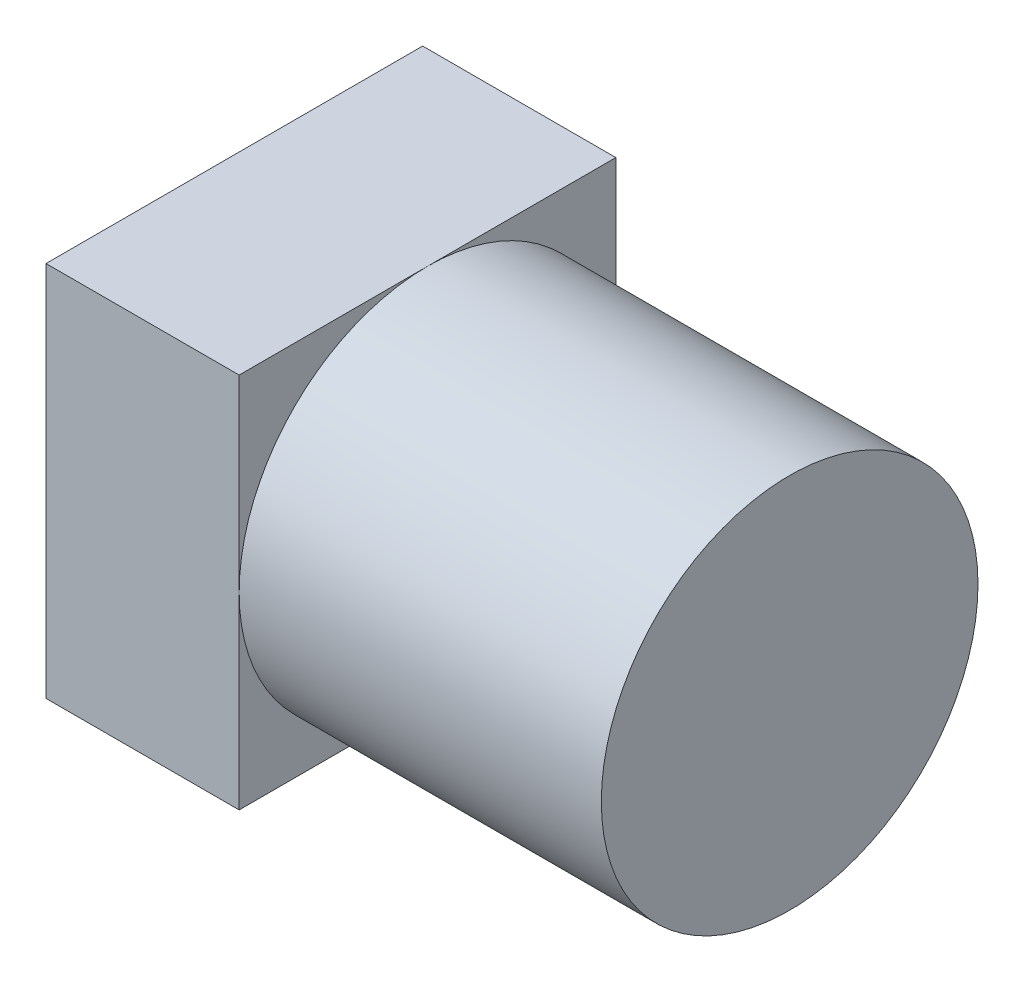
ISO-10303-21;
HEADER;
FILE_DESCRIPTION(('STEP AP214'),'2;1');
FILE_NAME('part.step','',(''),(''),'','','');
FILE_SCHEMA(('AUTOMOTIVE_DESIGN { 1 0 10303 214 1 1 1 1 }'));
ENDSEC;
DATA;
#1=APPLICATION_CONTEXT('core data for automotive mechanical design processes');
#2=APPLICATION_PROTOCOL_DEFINITION('international standard','automotive_design',2000,#1);
#3=PRODUCT_CONTEXT('',#1,'mechanical');
#4=PRODUCT('Part','Part','',(#3));
#5=PRODUCT_RELATED_PRODUCT_CATEGORY('part','',(#4));
#6=PRODUCT_DEFINITION_FORMATION('','',#4);
#7=PRODUCT_DEFINITION_CONTEXT('part definition',#1,'design');
#8=PRODUCT_DEFINITION('design','',#6,#7);
#9=PRODUCT_DEFINITION_SHAPE('','',#8);
#10=(LENGTH_UNIT() NAMED_UNIT(*) SI_UNIT(.MILLI.,.METRE.));
#11=(NAMED_UNIT(*) PLANE_ANGLE_UNIT() SI_UNIT($,.RADIAN.));
#12=(NAMED_UNIT(*) SI_UNIT($,.STERADIAN.) SOLID_ANGLE_UNIT());
#13=UNCERTAINTY_MEASURE_WITH_UNIT(LENGTH_MEASURE(1.E-05),#10,'distance_accuracy_value','');
#14=(GEOMETRIC_REPRESENTATION_CONTEXT(3) GLOBAL_UNCERTAINTY_ASSIGNED_CONTEXT((#13)) GLOBAL_UNIT_ASSIGNED_CONTEXT((#10,
#11,#12)) REPRESENTATION_CONTEXT('',''));
#15=CARTESIAN_POINT('',(0.,0.,0.));
#16=DIRECTION('',(0.,0.,1.));
#17=DIRECTION('',(1.,0.,0.));
#18=AXIS2_PLACEMENT_3D('',#15,#16,#17);
#19=CARTESIAN_POINT('',(8.,0.,0.));
#20=DIRECTION('',(1.,0.,0.));
#21=DIRECTION('',(0.,0.,-1.));
#22=AXIS2_PLACEMENT_3D('',#19,#20,#21);
#23=PLANE('',#22);
#24=CARTESIAN_POINT('',(8.,0.,0.));
#25=DIRECTION('',(1.,0.,0.));
#26=DIRECTION('',(0.,0.,-1.));
#27=AXIS2_PLACEMENT_3D('',#24,#25,#26);
#28=CIRCLE('',#27,7.8);
#29=CARTESIAN_POINT('',(8.,0.,-7.8));
#30=VERTEX_POINT('',#29);
#31=CARTESIAN_POINT('',(8.,7.8,0.));
#32=VERTEX_POINT('',#31);
#33=EDGE_CURVE('E51',#30,#32,#28,.T.);
#34=ORIENTED_EDGE('',*,*,#33,.F.);
#35=DIRECTION('',(0.,1.,0.));
#36=VECTOR('',#35,1.);
#37=CARTESIAN_POINT('',(8.,7.8,-7.8));
#38=LINE('',#37,#36);
#39=CARTESIAN_POINT('',(8.,7.8,-7.8));
#40=VERTEX_POINT('',#39);
#41=EDGE_CURVE('E103',#30,#40,#38,.T.);
#42=ORIENTED_EDGE('',*,*,#41,.T.);
#43=DIRECTION('',(0.,0.,1.));
#44=VECTOR('',#43,1.);
#45=CARTESIAN_POINT('',(8.,7.8,7.8));
#46=LINE('',#45,#44);
#47=EDGE_CURVE('E115',#40,#32,#46,.T.);
#48=ORIENTED_EDGE('',*,*,#47,.T.);
#49=EDGE_LOOP('',(#34,#42,#48));
#50=FACE_BOUND('',#49,.T.);
#51=ADVANCED_FACE('F39',(#50),#23,.T.);
#52=CARTESIAN_POINT('',(8.,0.,7.8));
#53=VERTEX_POINT('',#52);
#54=EDGE_CURVE('E11',#32,#53,#28,.T.);
#55=ORIENTED_EDGE('',*,*,#54,.F.);
#56=CARTESIAN_POINT('',(8.,7.8,7.8));
#57=VERTEX_POINT('',#56);
#58=EDGE_CURVE('E102',#32,#57,#46,.T.);
#59=ORIENTED_EDGE('',*,*,#58,.T.);
#60=DIRECTION('',(0.,-1.,0.));
#61=VECTOR('',#60,1.);
#62=CARTESIAN_POINT('',(8.,7.8,7.8));
#63=LINE('',#62,#61);
#64=EDGE_CURVE('E129',#57,#53,#63,.T.);
#65=ORIENTED_EDGE('',*,*,#64,.T.);
#66=EDGE_LOOP('',(#55,#59,#65));
#67=FACE_BOUND('',#66,.T.);
#68=ADVANCED_FACE('F172',(#67),#23,.T.);
#69=CARTESIAN_POINT('',(8.,-7.8,0.));
#70=VERTEX_POINT('',#69);
#71=EDGE_CURVE('E49',#53,#70,#28,.T.);
#72=ORIENTED_EDGE('',*,*,#71,.F.);
#73=CARTESIAN_POINT('',(8.,-7.8,7.8));
#74=VERTEX_POINT('',#73);
#75=EDGE_CURVE('E128',#53,#74,#63,.T.);
#76=ORIENTED_EDGE('',*,*,#75,.T.);
#77=DIRECTION('',(0.,0.,-1.));
#78=VECTOR('',#77,1.);
#79=CARTESIAN_POINT('',(8.,-7.8,7.8));
#80=LINE('',#79,#78);
#81=EDGE_CURVE('E133',#74,#70,#80,.T.);
#82=ORIENTED_EDGE('',*,*,#81,.T.);
#83=EDGE_LOOP('',(#72,#76,#82));
#84=FACE_BOUND('',#83,.T.);
#85=ADVANCED_FACE('F193',(#84),#23,.T.);
#86=CARTESIAN_POINT('',(8.,7.8,-7.8));
#87=DIRECTION('',(0.,0.,1.));
#88=DIRECTION('',(0.,-1.,0.));
#89=AXIS2_PLACEMENT_3D('',#86,#87,#88);
#90=PLANE('',#89);
#91=DIRECTION('',(0.,1.,0.));
#92=VECTOR('',#91,1.);
#93=CARTESIAN_POINT('',(0.,7.8,-7.8));
#94=LINE('',#93,#92);
#95=CARTESIAN_POINT('',(0.,-7.8,-7.8));
#96=VERTEX_POINT('',#95);
#97=CARTESIAN_POINT('',(0.,7.8,-7.8));
#98=VERTEX_POINT('',#97);
#99=EDGE_CURVE('E137',#96,#98,#94,.T.);
#100=ORIENTED_EDGE('',*,*,#99,.T.);
#101=DIRECTION('',(-1.,0.,0.));
#102=VECTOR('',#101,1.);
#103=CARTESIAN_POINT('',(8.,7.8,-7.8));
#104=LINE('',#103,#102);
#105=EDGE_CURVE('E43',#40,#98,#104,.T.);
#106=ORIENTED_EDGE('',*,*,#105,.F.);
#107=ORIENTED_EDGE('',*,*,#41,.F.);
#108=CARTESIAN_POINT('',(8.,-7.8,-7.8));
#109=VERTEX_POINT('',#108);
#110=EDGE_CURVE('E94',#109,#30,#38,.T.);
#111=ORIENTED_EDGE('',*,*,#110,.F.);
#112=DIRECTION('',(-1.,0.,0.));
#113=VECTOR('',#112,1.);
#114=CARTESIAN_POINT('',(8.,-7.8,-7.8));
#115=LINE('',#114,#113);
#116=EDGE_CURVE('E136',#109,#96,#115,.T.);
#117=ORIENTED_EDGE('',*,*,#116,.T.);
#118=EDGE_LOOP('',(#100,#106,#107,#111,#117));
#119=FACE_BOUND('',#118,.T.);
#120=ADVANCED_FACE('F41',(#119),#90,.F.);
#121=CARTESIAN_POINT('',(8.,7.8,7.8));
#122=DIRECTION('',(0.,-1.,0.));
#123=DIRECTION('',(0.,0.,-1.));
#124=AXIS2_PLACEMENT_3D('',#121,#122,#123);
#125=PLANE('',#124);
#126=DIRECTION('',(0.,0.,1.));
#127=VECTOR('',#126,1.);
#128=CARTESIAN_POINT('',(0.,7.8,7.8));
#129=LINE('',#128,#127);
#130=CARTESIAN_POINT('',(0.,7.8,7.8));
#131=VERTEX_POINT('',#130);
#132=EDGE_CURVE('E140',#98,#131,#129,.T.);
#133=ORIENTED_EDGE('',*,*,#132,.T.);
#134=DIRECTION('',(-1.,0.,0.));
#135=VECTOR('',#134,1.);
#136=CARTESIAN_POINT('',(8.,7.8,7.8));
#137=LINE('',#136,#135);
#138=EDGE_CURVE('E123',#57,#131,#137,.T.);
#139=ORIENTED_EDGE('',*,*,#138,.F.);
#140=ORIENTED_EDGE('',*,*,#58,.F.);
#141=ORIENTED_EDGE('',*,*,#47,.F.);
#142=ORIENTED_EDGE('',*,*,#105,.T.);
#143=EDGE_LOOP('',(#133,#139,#140,#141,#142));
#144=FACE_BOUND('',#143,.T.);
#145=ADVANCED_FACE('F203',(#144),#125,.F.);
#146=CARTESIAN_POINT('',(8.,7.8,7.8));
#147=DIRECTION('',(0.,0.,-1.));
#148=DIRECTION('',(0.,1.,0.));
#149=AXIS2_PLACEMENT_3D('',#146,#147,#148);
#150=PLANE('',#149);
#151=DIRECTION('',(0.,-1.,0.));
#152=VECTOR('',#151,1.);
#153=CARTESIAN_POINT('',(0.,7.8,7.8));
#154=LINE('',#153,#152);
#155=CARTESIAN_POINT('',(0.,-7.8,7.8));
#156=VERTEX_POINT('',#155);
#157=EDGE_CURVE('E143',#131,#156,#154,.T.);
#158=ORIENTED_EDGE('',*,*,#157,.T.);
#159=DIRECTION('',(-1.,0.,0.));
#160=VECTOR('',#159,1.);
#161=CARTESIAN_POINT('',(8.,-7.8,7.8));
#162=LINE('',#161,#160);
#163=EDGE_CURVE('E150',#74,#156,#162,.T.);
#164=ORIENTED_EDGE('',*,*,#163,.F.);
#165=ORIENTED_EDGE('',*,*,#75,.F.);
#166=ORIENTED_EDGE('',*,*,#64,.F.);
#167=ORIENTED_EDGE('',*,*,#138,.T.);
#168=EDGE_LOOP('',(#158,#164,#165,#166,#167));
#169=FACE_BOUND('',#168,.T.);
#170=ADVANCED_FACE('F159',(#169),#150,.F.);
#171=CARTESIAN_POINT('',(8.,-7.8,7.8));
#172=DIRECTION('',(0.,1.,0.));
#173=DIRECTION('',(0.,0.,1.));
#174=AXIS2_PLACEMENT_3D('',#171,#172,#173);
#175=PLANE('',#174);
#176=DIRECTION('',(0.,0.,-1.));
#177=VECTOR('',#176,1.);
#178=CARTESIAN_POINT('',(0.,-7.8,7.8));
#179=LINE('',#178,#177);
#180=EDGE_CURVE('E113',#156,#96,#179,.T.);
#181=ORIENTED_EDGE('',*,*,#180,.T.);
#182=ORIENTED_EDGE('',*,*,#116,.F.);
#183=EDGE_CURVE('E97',#70,#109,#80,.T.);
#184=ORIENTED_EDGE('',*,*,#183,.F.);
#185=ORIENTED_EDGE('',*,*,#81,.F.);
#186=ORIENTED_EDGE('',*,*,#163,.T.);
#187=EDGE_LOOP('',(#181,#182,#184,#185,#186));
#188=FACE_BOUND('',#187,.T.);
#189=ADVANCED_FACE('F168',(#188),#175,.F.);
#190=EDGE_CURVE('E58',#70,#30,#28,.T.);
#191=ORIENTED_EDGE('',*,*,#190,.F.);
#192=ORIENTED_EDGE('',*,*,#183,.T.);
#193=ORIENTED_EDGE('',*,*,#110,.T.);
#194=EDGE_LOOP('',(#191,#192,#193));
#195=FACE_BOUND('',#194,.T.);
#196=ADVANCED_FACE('F96',(#195),#23,.T.);
#197=CARTESIAN_POINT('',(0.,0.,0.));
#198=DIRECTION('',(1.,0.,0.));
#199=DIRECTION('',(0.,0.,-1.));
#200=AXIS2_PLACEMENT_3D('',#197,#198,#199);
#201=PLANE('',#200);
#202=ORIENTED_EDGE('',*,*,#99,.F.);
#203=ORIENTED_EDGE('',*,*,#180,.F.);
#204=ORIENTED_EDGE('',*,*,#157,.F.);
#205=ORIENTED_EDGE('',*,*,#132,.F.);
#206=EDGE_LOOP('',(#202,#203,#204,#205));
#207=FACE_BOUND('',#206,.T.);
#208=ADVANCED_FACE('F166',(#207),#201,.F.);
#209=CARTESIAN_POINT('',(23.,0.,0.));
#210=DIRECTION('',(-1.,0.,0.));
#211=DIRECTION('',(0.,0.,1.));
#212=AXIS2_PLACEMENT_3D('',#209,#210,#211);
#213=CYLINDRICAL_SURFACE('',#212,7.8);
#214=CARTESIAN_POINT('',(23.,0.,0.));
#215=DIRECTION('',(1.,0.,0.));
#216=DIRECTION('',(0.,0.,-1.));
#217=AXIS2_PLACEMENT_3D('',#214,#215,#216);
#218=CIRCLE('',#217,7.8);
#219=CARTESIAN_POINT('',(23.,0.,-7.8));
#220=VERTEX_POINT('',#219);
#221=EDGE_CURVE('E118',#220,#220,#218,.T.);
#222=ORIENTED_EDGE('',*,*,#221,.F.);
#223=EDGE_LOOP('',(#222));
#224=FACE_BOUND('',#223,.T.);
#225=ORIENTED_EDGE('',*,*,#33,.T.);
#226=ORIENTED_EDGE('',*,*,#54,.T.);
#227=ORIENTED_EDGE('',*,*,#71,.T.);
#228=ORIENTED_EDGE('',*,*,#190,.T.);
#229=EDGE_LOOP('',(#225,#226,#227,#228));
#230=FACE_BOUND('',#229,.T.);
#231=ADVANCED_FACE('F119',(#224,#230),#213,.T.);
#232=CARTESIAN_POINT('',(23.,0.,0.));
#233=DIRECTION('',(1.,0.,0.));
#234=DIRECTION('',(0.,0.,-1.));
#235=AXIS2_PLACEMENT_3D('',#232,#233,#234);
#236=PLANE('',#235);
#237=ORIENTED_EDGE('',*,*,#221,.T.);
#238=EDGE_LOOP('',(#237));
#239=FACE_BOUND('',#238,.T.);
#240=ADVANCED_FACE('F178',(#239),#236,.T.);
#241=CLOSED_SHELL('',(#51,#68,#85,#120,#145,#170,#189,#196,#208,#231,#240));
#242=MANIFOLD_SOLID_BREP('B2',#241);
#243=ADVANCED_BREP_SHAPE_REPRESENTATION('',(#18,#242),#14);
#244=SHAPE_DEFINITION_REPRESENTATION(#9,#243);
ENDSEC;
END-ISO-10303-21;
